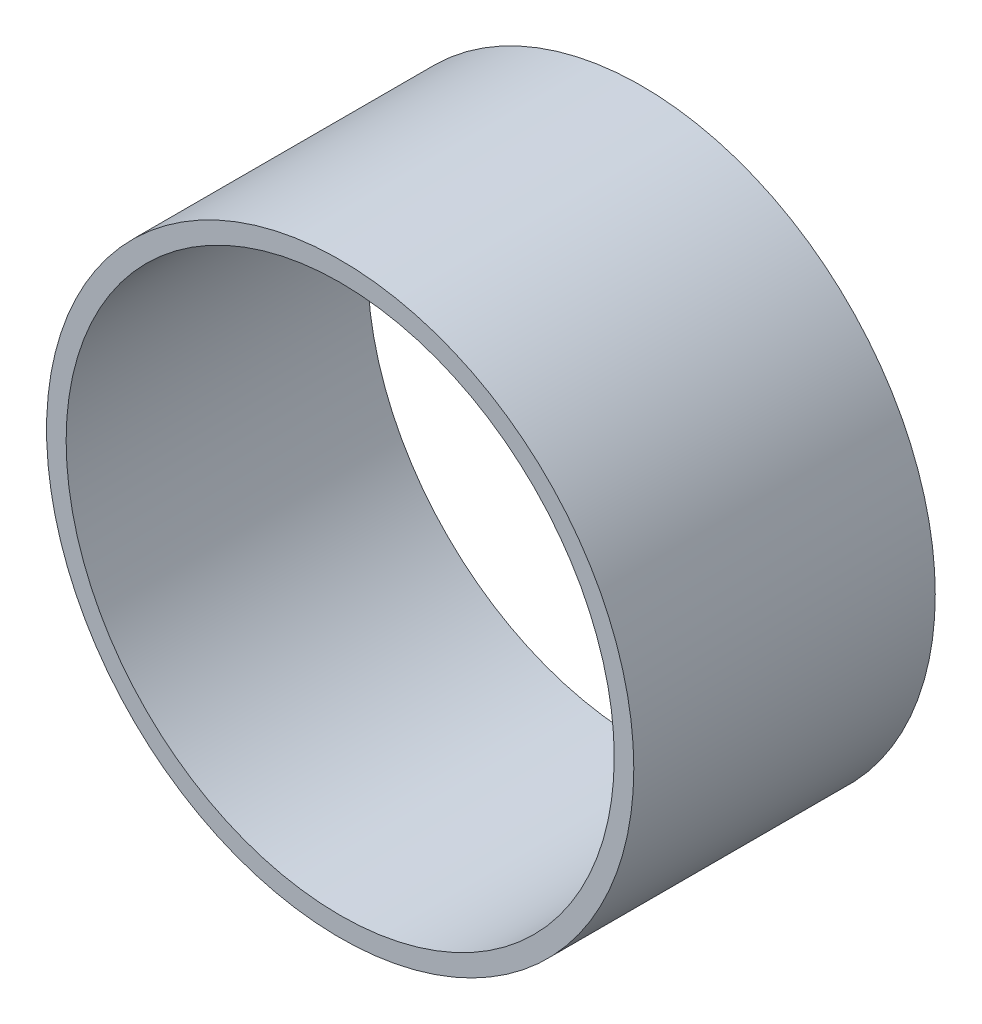
ISO-10303-21;
HEADER;
FILE_DESCRIPTION(('STEP AP214'),'2;1');
FILE_NAME('part.step','',(''),(''),'','','');
FILE_SCHEMA(('AUTOMOTIVE_DESIGN { 1 0 10303 214 1 1 1 1 }'));
ENDSEC;
DATA;
#1=APPLICATION_CONTEXT('core data for automotive mechanical design processes');
#2=APPLICATION_PROTOCOL_DEFINITION('international standard','automotive_design',2000,#1);
#3=PRODUCT_CONTEXT('',#1,'mechanical');
#4=PRODUCT('Part','Part','',(#3));
#5=PRODUCT_RELATED_PRODUCT_CATEGORY('part','',(#4));
#6=PRODUCT_DEFINITION_FORMATION('','',#4);
#7=PRODUCT_DEFINITION_CONTEXT('part definition',#1,'design');
#8=PRODUCT_DEFINITION('design','',#6,#7);
#9=PRODUCT_DEFINITION_SHAPE('','',#8);
#10=(LENGTH_UNIT() NAMED_UNIT(*) SI_UNIT(.MILLI.,.METRE.));
#11=(NAMED_UNIT(*) PLANE_ANGLE_UNIT() SI_UNIT($,.RADIAN.));
#12=(NAMED_UNIT(*) SI_UNIT($,.STERADIAN.) SOLID_ANGLE_UNIT());
#13=UNCERTAINTY_MEASURE_WITH_UNIT(LENGTH_MEASURE(1.E-05),#10,'distance_accuracy_value','');
#14=(GEOMETRIC_REPRESENTATION_CONTEXT(3) GLOBAL_UNCERTAINTY_ASSIGNED_CONTEXT((#13)) GLOBAL_UNIT_ASSIGNED_CONTEXT((#10,
#11,#12)) REPRESENTATION_CONTEXT('',''));
#15=CARTESIAN_POINT('',(0.,0.,0.));
#16=DIRECTION('',(0.,0.,1.));
#17=DIRECTION('',(1.,0.,0.));
#18=AXIS2_PLACEMENT_3D('',#15,#16,#17);
#19=CARTESIAN_POINT('',(0.,0.,0.));
#20=DIRECTION('',(0.,0.,-1.));
#21=DIRECTION('',(1.,0.,0.));
#22=AXIS2_PLACEMENT_3D('',#19,#20,#21);
#23=CYLINDRICAL_SURFACE('',#22,0.381);
#24=CARTESIAN_POINT('',(0.,0.,0.39116));
#25=DIRECTION('',(0.,0.,1.));
#26=DIRECTION('',(1.,0.,0.));
#27=AXIS2_PLACEMENT_3D('',#24,#25,#26);
#28=CIRCLE('',#27,0.381);
#29=CARTESIAN_POINT('',(0.381,0.,0.39116));
#30=VERTEX_POINT('',#29);
#31=EDGE_CURVE('E11',#30,#30,#28,.T.);
#32=ORIENTED_EDGE('',*,*,#31,.F.);
#33=DIRECTION('',(0.,0.,1.));
#34=VECTOR('',#33,1.);
#35=CARTESIAN_POINT('',(0.381,0.,0.));
#36=LINE('',#35,#34);
#37=CARTESIAN_POINT('',(0.381,0.,0.));
#38=VERTEX_POINT('',#37);
#39=EDGE_CURVE('E24',#38,#30,#36,.T.);
#40=ORIENTED_EDGE('',*,*,#39,.F.);
#41=CARTESIAN_POINT('',(0.,0.,0.));
#42=DIRECTION('',(0.,0.,1.));
#43=DIRECTION('',(1.,0.,0.));
#44=AXIS2_PLACEMENT_3D('',#41,#42,#43);
#45=CIRCLE('',#44,0.381);
#46=EDGE_CURVE('E46',#38,#38,#45,.T.);
#47=ORIENTED_EDGE('',*,*,#46,.T.);
#48=ORIENTED_EDGE('',*,*,#39,.T.);
#49=EDGE_LOOP('',(#32,#40,#47,#48));
#50=FACE_BOUND('',#49,.T.);
#51=ADVANCED_FACE('F17',(#50),#23,.T.);
#52=CARTESIAN_POINT('',(0.,0.,0.));
#53=DIRECTION('',(0.,0.,-1.));
#54=DIRECTION('',(1.,0.,0.));
#55=AXIS2_PLACEMENT_3D('',#52,#53,#54);
#56=CYLINDRICAL_SURFACE('',#55,0.3556);
#57=DIRECTION('',(0.,0.,1.));
#58=VECTOR('',#57,1.);
#59=CARTESIAN_POINT('',(0.3556,0.,0.));
#60=LINE('',#59,#58);
#61=CARTESIAN_POINT('',(0.3556,0.,0.));
#62=VERTEX_POINT('',#61);
#63=CARTESIAN_POINT('',(0.3556,0.,0.39116));
#64=VERTEX_POINT('',#63);
#65=EDGE_CURVE('E40',#62,#64,#60,.T.);
#66=ORIENTED_EDGE('',*,*,#65,.T.);
#67=CARTESIAN_POINT('',(0.,0.,0.39116));
#68=DIRECTION('',(0.,0.,1.));
#69=DIRECTION('',(1.,0.,0.));
#70=AXIS2_PLACEMENT_3D('',#67,#68,#69);
#71=CIRCLE('',#70,0.3556);
#72=EDGE_CURVE('E45',#64,#64,#71,.T.);
#73=ORIENTED_EDGE('',*,*,#72,.T.);
#74=ORIENTED_EDGE('',*,*,#65,.F.);
#75=CARTESIAN_POINT('',(0.,0.,0.));
#76=DIRECTION('',(0.,0.,1.));
#77=DIRECTION('',(1.,0.,0.));
#78=AXIS2_PLACEMENT_3D('',#75,#76,#77);
#79=CIRCLE('',#78,0.3556);
#80=EDGE_CURVE('E43',#62,#62,#79,.T.);
#81=ORIENTED_EDGE('',*,*,#80,.F.);
#82=EDGE_LOOP('',(#66,#73,#74,#81));
#83=FACE_BOUND('',#82,.T.);
#84=ADVANCED_FACE('F42',(#83),#56,.F.);
#85=CARTESIAN_POINT('',(0.381,0.,0.));
#86=DIRECTION('',(0.,0.,-1.));
#87=DIRECTION('',(-1.,0.,0.));
#88=AXIS2_PLACEMENT_3D('',#85,#86,#87);
#89=PLANE('',#88);
#90=ORIENTED_EDGE('',*,*,#46,.F.);
#91=EDGE_LOOP('',(#90));
#92=FACE_BOUND('',#91,.T.);
#93=ORIENTED_EDGE('',*,*,#80,.T.);
#94=EDGE_LOOP('',(#93));
#95=FACE_BOUND('',#94,.T.);
#96=ADVANCED_FACE('F49',(#92,#95),#89,.T.);
#97=CARTESIAN_POINT('',(0.381,0.,0.39116));
#98=DIRECTION('',(0.,0.,-1.));
#99=DIRECTION('',(-1.,0.,0.));
#100=AXIS2_PLACEMENT_3D('',#97,#98,#99);
#101=PLANE('',#100);
#102=ORIENTED_EDGE('',*,*,#31,.T.);
#103=EDGE_LOOP('',(#102));
#104=FACE_BOUND('',#103,.T.);
#105=ORIENTED_EDGE('',*,*,#72,.F.);
#106=EDGE_LOOP('',(#105));
#107=FACE_BOUND('',#106,.T.);
#108=ADVANCED_FACE('F56',(#104,#107),#101,.F.);
#109=CLOSED_SHELL('',(#51,#84,#96,#108));
#110=MANIFOLD_SOLID_BREP('B1',#109);
#111=ADVANCED_BREP_SHAPE_REPRESENTATION('',(#18,#110),#14);
#112=SHAPE_DEFINITION_REPRESENTATION(#9,#111);
ENDSEC;
END-ISO-10303-21;
